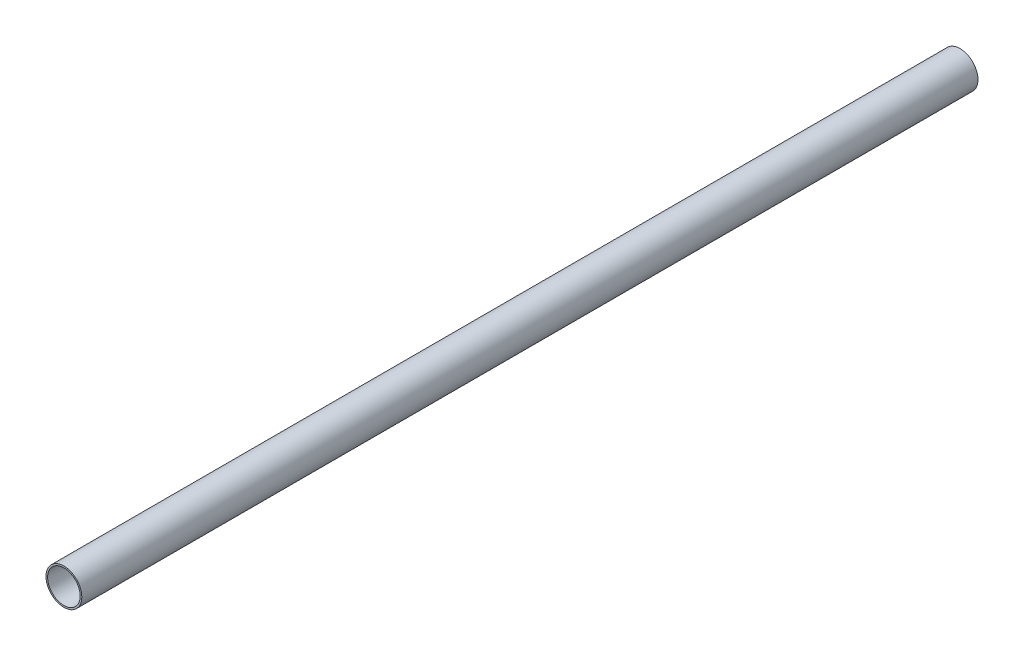
ISO-10303-21;
HEADER;
FILE_DESCRIPTION(('STEP AP214'),'2;1');
FILE_NAME('part.step','',(''),(''),'','','');
FILE_SCHEMA(('AUTOMOTIVE_DESIGN { 1 0 10303 214 1 1 1 1 }'));
ENDSEC;
DATA;
#1=APPLICATION_CONTEXT('core data for automotive mechanical design processes');
#2=APPLICATION_PROTOCOL_DEFINITION('international standard','automotive_design',2000,#1);
#3=PRODUCT_CONTEXT('',#1,'mechanical');
#4=PRODUCT('Part','Part','',(#3));
#5=PRODUCT_RELATED_PRODUCT_CATEGORY('part','',(#4));
#6=PRODUCT_DEFINITION_FORMATION('','',#4);
#7=PRODUCT_DEFINITION_CONTEXT('part definition',#1,'design');
#8=PRODUCT_DEFINITION('design','',#6,#7);
#9=PRODUCT_DEFINITION_SHAPE('','',#8);
#10=(LENGTH_UNIT() NAMED_UNIT(*) SI_UNIT(.MILLI.,.METRE.));
#11=(NAMED_UNIT(*) PLANE_ANGLE_UNIT() SI_UNIT($,.RADIAN.));
#12=(NAMED_UNIT(*) SI_UNIT($,.STERADIAN.) SOLID_ANGLE_UNIT());
#13=UNCERTAINTY_MEASURE_WITH_UNIT(LENGTH_MEASURE(1.E-05),#10,'distance_accuracy_value','');
#14=(GEOMETRIC_REPRESENTATION_CONTEXT(3) GLOBAL_UNCERTAINTY_ASSIGNED_CONTEXT((#13)) GLOBAL_UNIT_ASSIGNED_CONTEXT((#10,
#11,#12)) REPRESENTATION_CONTEXT('',''));
#15=CARTESIAN_POINT('',(0.,0.,0.));
#16=DIRECTION('',(0.,0.,1.));
#17=DIRECTION('',(1.,0.,0.));
#18=AXIS2_PLACEMENT_3D('',#15,#16,#17);
#19=CARTESIAN_POINT('',(0.,0.,550.));
#20=DIRECTION('',(0.,0.,1.));
#21=DIRECTION('',(1.,0.,0.));
#22=AXIS2_PLACEMENT_3D('',#19,#20,#21);
#23=PLANE('',#22);
#24=CARTESIAN_POINT('',(0.,0.,550.));
#25=DIRECTION('',(0.,0.,1.));
#26=DIRECTION('',(1.,0.,0.));
#27=AXIS2_PLACEMENT_3D('',#24,#25,#26);
#28=CIRCLE('',#27,11.);
#29=CARTESIAN_POINT('',(11.,0.,550.));
#30=VERTEX_POINT('',#29);
#31=EDGE_CURVE('E10',#30,#30,#28,.T.);
#32=ORIENTED_EDGE('',*,*,#31,.T.);
#33=EDGE_LOOP('',(#32));
#34=FACE_BOUND('',#33,.T.);
#35=CARTESIAN_POINT('',(0.,0.,550.));
#36=DIRECTION('',(0.,0.,1.));
#37=DIRECTION('',(1.,0.,0.));
#38=AXIS2_PLACEMENT_3D('',#35,#36,#37);
#39=CIRCLE('',#38,10.);
#40=CARTESIAN_POINT('',(10.,0.,550.));
#41=VERTEX_POINT('',#40);
#42=EDGE_CURVE('E50',#41,#41,#39,.T.);
#43=ORIENTED_EDGE('',*,*,#42,.F.);
#44=EDGE_LOOP('',(#43));
#45=FACE_BOUND('',#44,.T.);
#46=ADVANCED_FACE('F39',(#34,#45),#23,.T.);
#47=CARTESIAN_POINT('',(0.,0.,0.));
#48=DIRECTION('',(0.,0.,1.));
#49=DIRECTION('',(1.,0.,0.));
#50=AXIS2_PLACEMENT_3D('',#47,#48,#49);
#51=PLANE('',#50);
#52=CARTESIAN_POINT('',(0.,0.,0.));
#53=DIRECTION('',(0.,0.,1.));
#54=DIRECTION('',(1.,0.,0.));
#55=AXIS2_PLACEMENT_3D('',#52,#53,#54);
#56=CIRCLE('',#55,11.);
#57=CARTESIAN_POINT('',(11.,0.,0.));
#58=VERTEX_POINT('',#57);
#59=EDGE_CURVE('E43',#58,#58,#56,.T.);
#60=ORIENTED_EDGE('',*,*,#59,.F.);
#61=EDGE_LOOP('',(#60));
#62=FACE_BOUND('',#61,.T.);
#63=CARTESIAN_POINT('',(0.,0.,0.));
#64=DIRECTION('',(0.,0.,1.));
#65=DIRECTION('',(1.,0.,0.));
#66=AXIS2_PLACEMENT_3D('',#63,#64,#65);
#67=CIRCLE('',#66,10.);
#68=CARTESIAN_POINT('',(10.,0.,0.));
#69=VERTEX_POINT('',#68);
#70=EDGE_CURVE('E52',#69,#69,#67,.T.);
#71=ORIENTED_EDGE('',*,*,#70,.T.);
#72=EDGE_LOOP('',(#71));
#73=FACE_BOUND('',#72,.T.);
#74=ADVANCED_FACE('F62',(#62,#73),#51,.F.);
#75=CARTESIAN_POINT('',(0.,0.,550.));
#76=DIRECTION('',(0.,0.,-1.));
#77=DIRECTION('',(-1.,0.,0.));
#78=AXIS2_PLACEMENT_3D('',#75,#76,#77);
#79=CYLINDRICAL_SURFACE('',#78,11.);
#80=ORIENTED_EDGE('',*,*,#31,.F.);
#81=EDGE_LOOP('',(#80));
#82=FACE_BOUND('',#81,.T.);
#83=ORIENTED_EDGE('',*,*,#59,.T.);
#84=EDGE_LOOP('',(#83));
#85=FACE_BOUND('',#84,.T.);
#86=ADVANCED_FACE('F41',(#82,#85),#79,.T.);
#87=CARTESIAN_POINT('',(0.,0.,550.));
#88=DIRECTION('',(0.,0.,-1.));
#89=DIRECTION('',(-1.,0.,0.));
#90=AXIS2_PLACEMENT_3D('',#87,#88,#89);
#91=CYLINDRICAL_SURFACE('',#90,10.);
#92=ORIENTED_EDGE('',*,*,#42,.T.);
#93=EDGE_LOOP('',(#92));
#94=FACE_BOUND('',#93,.T.);
#95=ORIENTED_EDGE('',*,*,#70,.F.);
#96=EDGE_LOOP('',(#95));
#97=FACE_BOUND('',#96,.T.);
#98=ADVANCED_FACE('F58',(#94,#97),#91,.F.);
#99=CLOSED_SHELL('',(#46,#74,#86,#98));
#100=MANIFOLD_SOLID_BREP('B2',#99);
#101=ADVANCED_BREP_SHAPE_REPRESENTATION('',(#18,#100),#14);
#102=SHAPE_DEFINITION_REPRESENTATION(#9,#101);
ENDSEC;
END-ISO-10303-21;
